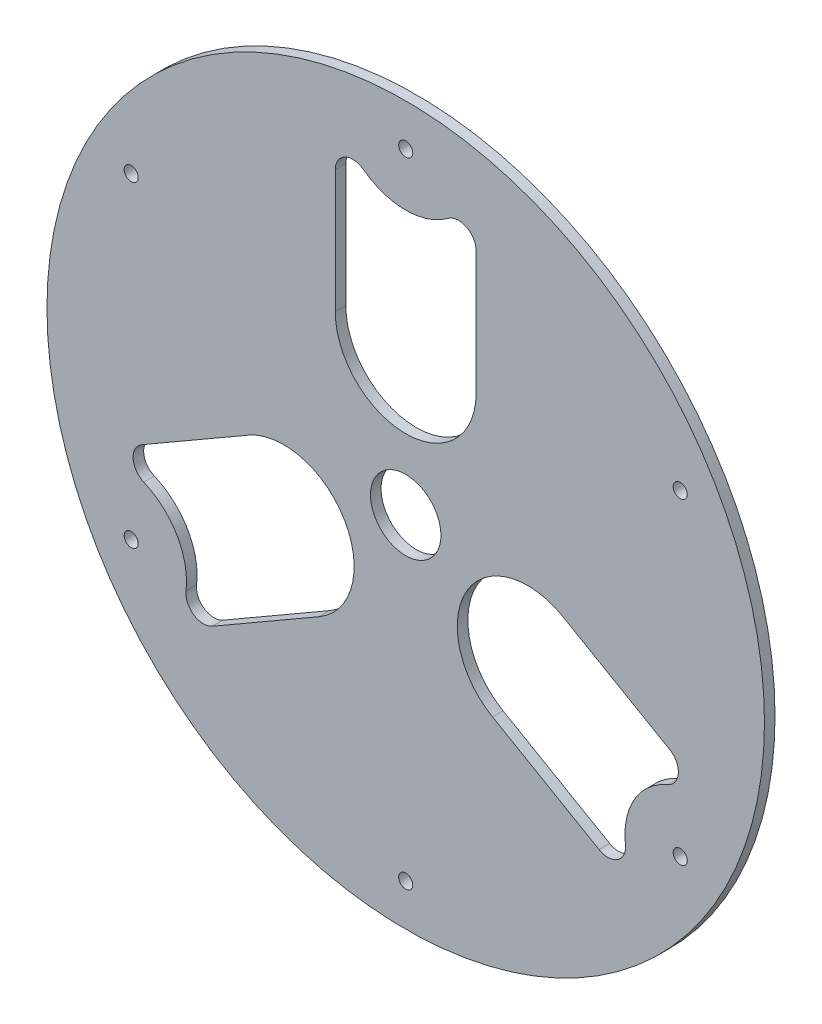
ISO-10303-21;
HEADER;
FILE_DESCRIPTION(('STEP AP214'),'2;1');
FILE_NAME('part.step','',(''),(''),'','','');
FILE_SCHEMA(('AUTOMOTIVE_DESIGN { 1 0 10303 214 1 1 1 1 }'));
ENDSEC;
DATA;
#1=APPLICATION_CONTEXT('core data for automotive mechanical design processes');
#2=APPLICATION_PROTOCOL_DEFINITION('international standard','automotive_design',2000,#1);
#3=PRODUCT_CONTEXT('',#1,'mechanical');
#4=PRODUCT('Part','Part','',(#3));
#5=PRODUCT_RELATED_PRODUCT_CATEGORY('part','',(#4));
#6=PRODUCT_DEFINITION_FORMATION('','',#4);
#7=PRODUCT_DEFINITION_CONTEXT('part definition',#1,'design');
#8=PRODUCT_DEFINITION('design','',#6,#7);
#9=PRODUCT_DEFINITION_SHAPE('','',#8);
#10=(LENGTH_UNIT() NAMED_UNIT(*) SI_UNIT(.MILLI.,.METRE.));
#11=(NAMED_UNIT(*) PLANE_ANGLE_UNIT() SI_UNIT($,.RADIAN.));
#12=(NAMED_UNIT(*) SI_UNIT($,.STERADIAN.) SOLID_ANGLE_UNIT());
#13=UNCERTAINTY_MEASURE_WITH_UNIT(LENGTH_MEASURE(1.E-05),#10,'distance_accuracy_value','');
#14=(GEOMETRIC_REPRESENTATION_CONTEXT(3) GLOBAL_UNCERTAINTY_ASSIGNED_CONTEXT((#13)) GLOBAL_UNIT_ASSIGNED_CONTEXT((#10,
#11,#12)) REPRESENTATION_CONTEXT('',''));
#15=CARTESIAN_POINT('',(0.,0.,0.));
#16=DIRECTION('',(0.,0.,1.));
#17=DIRECTION('',(1.,0.,0.));
#18=AXIS2_PLACEMENT_3D('',#15,#16,#17);
#19=CARTESIAN_POINT('',(0.,0.,3.));
#20=DIRECTION('',(0.,0.,1.));
#21=DIRECTION('',(1.,0.,0.));
#22=AXIS2_PLACEMENT_3D('',#19,#20,#21);
#23=PLANE('',#22);
#24=CARTESIAN_POINT('',(-77.9422863405937,-45.0000000000033,3.));
#25=DIRECTION('',(0.,0.,1.));
#26=DIRECTION('',(1.,0.,0.));
#27=AXIS2_PLACEMENT_3D('',#24,#25,#26);
#28=CIRCLE('',#27,2.0000000000073);
#29=CARTESIAN_POINT('',(-75.9422863405864,-45.0000000000033,3.));
#30=VERTEX_POINT('',#29);
#31=EDGE_CURVE('E340',#30,#30,#28,.T.);
#32=ORIENTED_EDGE('',*,*,#31,.F.);
#33=EDGE_LOOP('',(#32));
#34=FACE_BOUND('',#33,.T.);
#35=CARTESIAN_POINT('',(77.9422863406052,-44.9999999999967,3.));
#36=DIRECTION('',(0.,0.,1.));
#37=DIRECTION('',(1.,0.,0.));
#38=AXIS2_PLACEMENT_3D('',#35,#36,#37);
#39=CIRCLE('',#38,2.00000000000493);
#40=CARTESIAN_POINT('',(79.9422863406102,-44.9999999999967,3.));
#41=VERTEX_POINT('',#40);
#42=EDGE_CURVE('E343',#41,#41,#39,.T.);
#43=ORIENTED_EDGE('',*,*,#42,.F.);
#44=EDGE_LOOP('',(#43));
#45=FACE_BOUND('',#44,.T.);
#46=DIRECTION('',(0.866025403784438,0.5,0.));
#47=VECTOR('',#46,1.);
#48=CARTESIAN_POINT('',(-54.9130085495895,-54.7980510357057,3.));
#49=LINE('',#48,#47);
#50=CARTESIAN_POINT('',(-54.9130085495895,-54.7980510357057,3.));
#51=VERTEX_POINT('',#50);
#52=CARTESIAN_POINT('',(-24.641016151375,-37.3205080756902,3.));
#53=VERTEX_POINT('',#52);
#54=EDGE_CURVE('E166',#51,#53,#49,.T.);
#55=ORIENTED_EDGE('',*,*,#54,.F.);
#56=CARTESIAN_POINT('',(-57.4130085495894,-50.4679240167835,3.));
#57=DIRECTION('',(0.,0.,1.));
#58=DIRECTION('',(1.,0.,0.));
#59=AXIS2_PLACEMENT_3D('',#56,#57,#58);
#60=CIRCLE('',#59,4.99999999999999);
#61=CARTESIAN_POINT('',(-62.3771101647272,-49.8698478054302,3.));
#62=VERTEX_POINT('',#61);
#63=EDGE_CURVE('E158',#62,#51,#60,.T.);
#64=ORIENTED_EDGE('',*,*,#63,.F.);
#65=CARTESIAN_POINT('',(-82.2335166252782,-47.477542960017,3.));
#66=DIRECTION('',(0.,0.,-1.));
#67=DIRECTION('',(1.,0.,0.));
#68=AXIS2_PLACEMENT_3D('',#65,#66,#67);
#69=CIRCLE('',#68,20.);
#70=CARTESIAN_POINT('',(-74.3771101647272,-29.0852381146037,3.));
#71=VERTEX_POINT('',#70);
#72=EDGE_CURVE('E189',#71,#62,#69,.T.);
#73=ORIENTED_EDGE('',*,*,#72,.F.);
#74=CARTESIAN_POINT('',(-72.4130085495895,-24.4871619032504,3.));
#75=DIRECTION('',(0.,0.,1.));
#76=DIRECTION('',(1.,0.,0.));
#77=AXIS2_PLACEMENT_3D('',#74,#75,#76);
#78=CIRCLE('',#77,5.);
#79=CARTESIAN_POINT('',(-74.9130085495895,-20.1570348843282,3.));
#80=VERTEX_POINT('',#79);
#81=EDGE_CURVE('E187',#80,#71,#78,.T.);
#82=ORIENTED_EDGE('',*,*,#81,.F.);
#83=DIRECTION('',(-0.866025403784438,-0.500000000000001,0.));
#84=VECTOR('',#83,1.);
#85=CARTESIAN_POINT('',(-74.9130085495895,-20.1570348843282,3.));
#86=LINE('',#85,#84);
#87=CARTESIAN_POINT('',(-44.641016151375,-2.67949192431272,3.));
#88=VERTEX_POINT('',#87);
#89=EDGE_CURVE('E182',#88,#80,#86,.T.);
#90=ORIENTED_EDGE('',*,*,#89,.F.);
#91=CARTESIAN_POINT('',(-34.641016151375,-20.0000000000015,3.));
#92=DIRECTION('',(0.,0.,1.));
#93=DIRECTION('',(1.,0.,0.));
#94=AXIS2_PLACEMENT_3D('',#91,#92,#93);
#95=CIRCLE('',#94,20.);
#96=EDGE_CURVE('E180',#53,#88,#95,.T.);
#97=ORIENTED_EDGE('',*,*,#96,.F.);
#98=EDGE_LOOP('',(#55,#64,#73,#82,#90,#97));
#99=FACE_BOUND('',#98,.T.);
#100=DIRECTION('',(-0.866025403784439,0.5,0.));
#101=VECTOR('',#100,1.);
#102=CARTESIAN_POINT('',(74.9130085495946,-20.1570348843252,3.));
#103=LINE('',#102,#101);
#104=CARTESIAN_POINT('',(74.9130085495946,-20.1570348843252,3.));
#105=VERTEX_POINT('',#104);
#106=CARTESIAN_POINT('',(44.6410161513801,-2.67949192430974,3.));
#107=VERTEX_POINT('',#106);
#108=EDGE_CURVE('E214',#105,#107,#103,.T.);
#109=ORIENTED_EDGE('',*,*,#108,.F.);
#110=CARTESIAN_POINT('',(72.4130085495946,-24.4871619032474,3.));
#111=DIRECTION('',(0.,0.,1.));
#112=DIRECTION('',(1.,0.,0.));
#113=AXIS2_PLACEMENT_3D('',#110,#111,#112);
#114=CIRCLE('',#113,5.);
#115=CARTESIAN_POINT('',(74.3771101647323,-29.0852381146007,3.));
#116=VERTEX_POINT('',#115);
#117=EDGE_CURVE('E212',#116,#105,#114,.T.);
#118=ORIENTED_EDGE('',*,*,#117,.F.);
#119=CARTESIAN_POINT('',(82.2335166252834,-47.477542960014,3.));
#120=DIRECTION('',(0.,0.,-1.));
#121=DIRECTION('',(1.,0.,0.));
#122=AXIS2_PLACEMENT_3D('',#119,#120,#121);
#123=CIRCLE('',#122,20.);
#124=CARTESIAN_POINT('',(62.3771101647323,-49.8698478054272,3.));
#125=VERTEX_POINT('',#124);
#126=EDGE_CURVE('E224',#125,#116,#123,.T.);
#127=ORIENTED_EDGE('',*,*,#126,.F.);
#128=CARTESIAN_POINT('',(57.4130085495946,-50.4679240167805,3.));
#129=DIRECTION('',(0.,0.,1.));
#130=DIRECTION('',(1.,0.,0.));
#131=AXIS2_PLACEMENT_3D('',#128,#129,#130);
#132=CIRCLE('',#131,5.);
#133=CARTESIAN_POINT('',(54.9130085495946,-54.7980510357027,3.));
#134=VERTEX_POINT('',#133);
#135=EDGE_CURVE('E221',#134,#125,#132,.T.);
#136=ORIENTED_EDGE('',*,*,#135,.F.);
#137=DIRECTION('',(0.866025403784439,-0.5,0.));
#138=VECTOR('',#137,1.);
#139=CARTESIAN_POINT('',(54.9130085495946,-54.7980510357027,3.));
#140=LINE('',#139,#138);
#141=CARTESIAN_POINT('',(24.6410161513801,-37.3205080756873,3.));
#142=VERTEX_POINT('',#141);
#143=EDGE_CURVE('E219',#142,#134,#140,.T.);
#144=ORIENTED_EDGE('',*,*,#143,.F.);
#145=CARTESIAN_POINT('',(34.6410161513801,-19.9999999999985,3.));
#146=DIRECTION('',(0.,0.,1.));
#147=DIRECTION('',(1.,0.,0.));
#148=AXIS2_PLACEMENT_3D('',#145,#146,#147);
#149=CIRCLE('',#148,20.);
#150=EDGE_CURVE('E217',#107,#142,#149,.T.);
#151=ORIENTED_EDGE('',*,*,#150,.F.);
#152=EDGE_LOOP('',(#109,#118,#127,#136,#144,#151));
#153=FACE_BOUND('',#152,.T.);
#154=CARTESIAN_POINT('',(0.,0.,3.));
#155=DIRECTION('',(0.,0.,1.));
#156=DIRECTION('',(1.,0.,0.));
#157=AXIS2_PLACEMENT_3D('',#154,#155,#156);
#158=CIRCLE('',#157,10.);
#159=CARTESIAN_POINT('',(10.,0.,3.));
#160=VERTEX_POINT('',#159);
#161=EDGE_CURVE('E257',#160,#160,#158,.T.);
#162=ORIENTED_EDGE('',*,*,#161,.F.);
#163=EDGE_LOOP('',(#162));
#164=FACE_BOUND('',#163,.T.);
#165=CARTESIAN_POINT('',(0.,0.,3.));
#166=DIRECTION('',(0.,0.,1.));
#167=DIRECTION('',(1.,0.,0.));
#168=AXIS2_PLACEMENT_3D('',#165,#166,#167);
#169=CIRCLE('',#168,101.859163578813);
#170=CARTESIAN_POINT('',(101.859163578813,0.,3.));
#171=VERTEX_POINT('',#170);
#172=EDGE_CURVE('E11',#171,#171,#169,.T.);
#173=ORIENTED_EDGE('',*,*,#172,.T.);
#174=EDGE_LOOP('',(#173));
#175=FACE_BOUND('',#174,.T.);
#176=CARTESIAN_POINT('',(0.,90.,3.));
#177=DIRECTION('',(0.,0.,1.));
#178=DIRECTION('',(1.,0.,0.));
#179=AXIS2_PLACEMENT_3D('',#176,#177,#178);
#180=CIRCLE('',#179,2.);
#181=CARTESIAN_POINT('',(2.,90.,3.));
#182=VERTEX_POINT('',#181);
#183=EDGE_CURVE('E308',#182,#182,#180,.T.);
#184=ORIENTED_EDGE('',*,*,#183,.F.);
#185=EDGE_LOOP('',(#184));
#186=FACE_BOUND('',#185,.T.);
#187=DIRECTION('',(0.,-1.,0.));
#188=VECTOR('',#187,1.);
#189=CARTESIAN_POINT('',(-20.,74.9550859200309,3.));
#190=LINE('',#189,#188);
#191=CARTESIAN_POINT('',(-20.,74.9550859200309,3.));
#192=VERTEX_POINT('',#191);
#193=CARTESIAN_POINT('',(-20.,40.,3.));
#194=VERTEX_POINT('',#193);
#195=EDGE_CURVE('E265',#192,#194,#190,.T.);
#196=ORIENTED_EDGE('',*,*,#195,.F.);
#197=CARTESIAN_POINT('',(-15.,74.9550859200309,3.));
#198=DIRECTION('',(0.,0.,1.));
#199=DIRECTION('',(1.,0.,0.));
#200=AXIS2_PLACEMENT_3D('',#197,#198,#199);
#201=CIRCLE('',#200,5.);
#202=CARTESIAN_POINT('',(-12.,78.9550859200309,3.));
#203=VERTEX_POINT('',#202);
#204=EDGE_CURVE('E263',#203,#192,#201,.T.);
#205=ORIENTED_EDGE('',*,*,#204,.F.);
#206=CARTESIAN_POINT('',(0.,94.9550859200309,3.));
#207=DIRECTION('',(0.,0.,-1.));
#208=DIRECTION('',(1.,0.,0.));
#209=AXIS2_PLACEMENT_3D('',#206,#207,#208);
#210=CIRCLE('',#209,20.);
#211=CARTESIAN_POINT('',(12.,78.9550859200309,3.));
#212=VERTEX_POINT('',#211);
#213=EDGE_CURVE('E275',#212,#203,#210,.T.);
#214=ORIENTED_EDGE('',*,*,#213,.F.);
#215=CARTESIAN_POINT('',(15.,74.9550859200309,3.));
#216=DIRECTION('',(0.,0.,1.));
#217=DIRECTION('',(1.,0.,0.));
#218=AXIS2_PLACEMENT_3D('',#215,#216,#217);
#219=CIRCLE('',#218,5.);
#220=CARTESIAN_POINT('',(20.,74.9550859200309,3.));
#221=VERTEX_POINT('',#220);
#222=EDGE_CURVE('E272',#221,#212,#219,.T.);
#223=ORIENTED_EDGE('',*,*,#222,.F.);
#224=DIRECTION('',(0.,1.,0.));
#225=VECTOR('',#224,1.);
#226=CARTESIAN_POINT('',(20.,74.9550859200309,3.));
#227=LINE('',#226,#225);
#228=CARTESIAN_POINT('',(20.,40.,3.));
#229=VERTEX_POINT('',#228);
#230=EDGE_CURVE('E270',#229,#221,#227,.T.);
#231=ORIENTED_EDGE('',*,*,#230,.F.);
#232=CARTESIAN_POINT('',(0.,40.,3.));
#233=DIRECTION('',(0.,0.,1.));
#234=DIRECTION('',(1.,0.,0.));
#235=AXIS2_PLACEMENT_3D('',#232,#233,#234);
#236=CIRCLE('',#235,20.);
#237=EDGE_CURVE('E268',#194,#229,#236,.T.);
#238=ORIENTED_EDGE('',*,*,#237,.F.);
#239=EDGE_LOOP('',(#196,#205,#214,#223,#231,#238));
#240=FACE_BOUND('',#239,.T.);
#241=CARTESIAN_POINT('',(77.9422863406014,45.0000000000033,3.));
#242=DIRECTION('',(0.,0.,1.));
#243=DIRECTION('',(1.,0.,0.));
#244=AXIS2_PLACEMENT_3D('',#241,#242,#243);
#245=CIRCLE('',#244,2.00000000000108);
#246=CARTESIAN_POINT('',(79.9422863406024,45.0000000000033,3.));
#247=VERTEX_POINT('',#246);
#248=EDGE_CURVE('E192',#247,#247,#245,.T.);
#249=ORIENTED_EDGE('',*,*,#248,.F.);
#250=EDGE_LOOP('',(#249));
#251=FACE_BOUND('',#250,.T.);
#252=CARTESIAN_POINT('',(7.65181790382443E-12,-90.,3.));
#253=DIRECTION('',(0.,0.,1.));
#254=DIRECTION('',(1.,0.,0.));
#255=AXIS2_PLACEMENT_3D('',#252,#253,#254);
#256=CIRCLE('',#255,2.00000000000792);
#257=CARTESIAN_POINT('',(2.00000000001557,-90.,3.));
#258=VERTEX_POINT('',#257);
#259=EDGE_CURVE('E350',#258,#258,#256,.T.);
#260=ORIENTED_EDGE('',*,*,#259,.F.);
#261=EDGE_LOOP('',(#260));
#262=FACE_BOUND('',#261,.T.);
#263=CARTESIAN_POINT('',(-77.9422863405976,44.9999999999966,3.));
#264=DIRECTION('',(0.,0.,1.));
#265=DIRECTION('',(1.,0.,0.));
#266=AXIS2_PLACEMENT_3D('',#263,#264,#265);
#267=CIRCLE('',#266,2.00000000000387);
#268=CARTESIAN_POINT('',(-75.9422863405937,44.9999999999966,3.));
#269=VERTEX_POINT('',#268);
#270=EDGE_CURVE('E368',#269,#269,#267,.T.);
#271=ORIENTED_EDGE('',*,*,#270,.F.);
#272=EDGE_LOOP('',(#271));
#273=FACE_BOUND('',#272,.T.);
#274=ADVANCED_FACE('F33',(#34,#45,#99,#153,#164,#175,#186,#240,#251,#262,#273),#23,.T.);
#275=CARTESIAN_POINT('',(0.,0.,0.));
#276=DIRECTION('',(0.,0.,1.));
#277=DIRECTION('',(1.,0.,0.));
#278=AXIS2_PLACEMENT_3D('',#275,#276,#277);
#279=PLANE('',#278);
#280=CARTESIAN_POINT('',(72.4130085495946,-24.4871619032474,0.));
#281=DIRECTION('',(0.,0.,1.));
#282=DIRECTION('',(1.,0.,0.));
#283=AXIS2_PLACEMENT_3D('',#280,#281,#282);
#284=CIRCLE('',#283,5.);
#285=CARTESIAN_POINT('',(74.3771101647323,-29.0852381146007,0.));
#286=VERTEX_POINT('',#285);
#287=CARTESIAN_POINT('',(74.9130085495946,-20.1570348843252,0.));
#288=VERTEX_POINT('',#287);
#289=EDGE_CURVE('E174',#286,#288,#284,.T.);
#290=ORIENTED_EDGE('',*,*,#289,.T.);
#291=DIRECTION('',(-0.866025403784439,0.5,0.));
#292=VECTOR('',#291,1.);
#293=CARTESIAN_POINT('',(74.9130085495946,-20.1570348843252,0.));
#294=LINE('',#293,#292);
#295=CARTESIAN_POINT('',(44.6410161513801,-2.67949192430974,0.));
#296=VERTEX_POINT('',#295);
#297=EDGE_CURVE('E229',#288,#296,#294,.T.);
#298=ORIENTED_EDGE('',*,*,#297,.T.);
#299=CARTESIAN_POINT('',(34.6410161513801,-19.9999999999985,0.));
#300=DIRECTION('',(0.,0.,1.));
#301=DIRECTION('',(1.,0.,0.));
#302=AXIS2_PLACEMENT_3D('',#299,#300,#301);
#303=CIRCLE('',#302,20.);
#304=CARTESIAN_POINT('',(24.6410161513801,-37.3205080756873,0.));
#305=VERTEX_POINT('',#304);
#306=EDGE_CURVE('E232',#296,#305,#303,.T.);
#307=ORIENTED_EDGE('',*,*,#306,.T.);
#308=DIRECTION('',(0.866025403784439,-0.5,0.));
#309=VECTOR('',#308,1.);
#310=CARTESIAN_POINT('',(54.9130085495946,-54.7980510357027,0.));
#311=LINE('',#310,#309);
#312=CARTESIAN_POINT('',(54.9130085495946,-54.7980510357027,0.));
#313=VERTEX_POINT('',#312);
#314=EDGE_CURVE('E235',#305,#313,#311,.T.);
#315=ORIENTED_EDGE('',*,*,#314,.T.);
#316=CARTESIAN_POINT('',(57.4130085495946,-50.4679240167805,0.));
#317=DIRECTION('',(0.,0.,1.));
#318=DIRECTION('',(1.,0.,0.));
#319=AXIS2_PLACEMENT_3D('',#316,#317,#318);
#320=CIRCLE('',#319,5.);
#321=CARTESIAN_POINT('',(62.3771101647323,-49.8698478054272,0.));
#322=VERTEX_POINT('',#321);
#323=EDGE_CURVE('E238',#313,#322,#320,.T.);
#324=ORIENTED_EDGE('',*,*,#323,.T.);
#325=CARTESIAN_POINT('',(82.2335166252834,-47.477542960014,0.));
#326=DIRECTION('',(0.,0.,-1.));
#327=DIRECTION('',(1.,0.,0.));
#328=AXIS2_PLACEMENT_3D('',#325,#326,#327);
#329=CIRCLE('',#328,20.);
#330=EDGE_CURVE('E215',#322,#286,#329,.T.);
#331=ORIENTED_EDGE('',*,*,#330,.T.);
#332=EDGE_LOOP('',(#290,#298,#307,#315,#324,#331));
#333=FACE_BOUND('',#332,.T.);
#334=CARTESIAN_POINT('',(0.,90.,0.));
#335=DIRECTION('',(0.,0.,1.));
#336=DIRECTION('',(1.,0.,0.));
#337=AXIS2_PLACEMENT_3D('',#334,#335,#336);
#338=CIRCLE('',#337,2.);
#339=CARTESIAN_POINT('',(2.,90.,0.));
#340=VERTEX_POINT('',#339);
#341=EDGE_CURVE('E307',#340,#340,#338,.T.);
#342=ORIENTED_EDGE('',*,*,#341,.T.);
#343=EDGE_LOOP('',(#342));
#344=FACE_BOUND('',#343,.T.);
#345=CARTESIAN_POINT('',(0.,0.,0.));
#346=DIRECTION('',(0.,0.,1.));
#347=DIRECTION('',(1.,0.,0.));
#348=AXIS2_PLACEMENT_3D('',#345,#346,#347);
#349=CIRCLE('',#348,101.859163578813);
#350=CARTESIAN_POINT('',(101.859163578813,0.,0.));
#351=VERTEX_POINT('',#350);
#352=EDGE_CURVE('E37',#351,#351,#349,.T.);
#353=ORIENTED_EDGE('',*,*,#352,.F.);
#354=EDGE_LOOP('',(#353));
#355=FACE_BOUND('',#354,.T.);
#356=CARTESIAN_POINT('',(-15.,74.9550859200309,0.));
#357=DIRECTION('',(0.,0.,1.));
#358=DIRECTION('',(1.,0.,0.));
#359=AXIS2_PLACEMENT_3D('',#356,#357,#358);
#360=CIRCLE('',#359,5.);
#361=CARTESIAN_POINT('',(-12.,78.9550859200309,0.));
#362=VERTEX_POINT('',#361);
#363=CARTESIAN_POINT('',(-20.,74.9550859200309,0.));
#364=VERTEX_POINT('',#363);
#365=EDGE_CURVE('E260',#362,#364,#360,.T.);
#366=ORIENTED_EDGE('',*,*,#365,.T.);
#367=DIRECTION('',(0.,-1.,0.));
#368=VECTOR('',#367,1.);
#369=CARTESIAN_POINT('',(-20.,74.9550859200309,0.));
#370=LINE('',#369,#368);
#371=CARTESIAN_POINT('',(-20.,40.,0.));
#372=VERTEX_POINT('',#371);
#373=EDGE_CURVE('E280',#364,#372,#370,.T.);
#374=ORIENTED_EDGE('',*,*,#373,.T.);
#375=CARTESIAN_POINT('',(0.,40.,0.));
#376=DIRECTION('',(0.,0.,1.));
#377=DIRECTION('',(1.,0.,0.));
#378=AXIS2_PLACEMENT_3D('',#375,#376,#377);
#379=CIRCLE('',#378,20.);
#380=CARTESIAN_POINT('',(20.,40.,0.));
#381=VERTEX_POINT('',#380);
#382=EDGE_CURVE('E283',#372,#381,#379,.T.);
#383=ORIENTED_EDGE('',*,*,#382,.T.);
#384=DIRECTION('',(0.,1.,0.));
#385=VECTOR('',#384,1.);
#386=CARTESIAN_POINT('',(20.,74.9550859200309,0.));
#387=LINE('',#386,#385);
#388=CARTESIAN_POINT('',(20.,74.9550859200309,0.));
#389=VERTEX_POINT('',#388);
#390=EDGE_CURVE('E286',#381,#389,#387,.T.);
#391=ORIENTED_EDGE('',*,*,#390,.T.);
#392=CARTESIAN_POINT('',(15.,74.9550859200309,0.));
#393=DIRECTION('',(0.,0.,1.));
#394=DIRECTION('',(1.,0.,0.));
#395=AXIS2_PLACEMENT_3D('',#392,#393,#394);
#396=CIRCLE('',#395,5.);
#397=CARTESIAN_POINT('',(12.,78.9550859200309,0.));
#398=VERTEX_POINT('',#397);
#399=EDGE_CURVE('E289',#389,#398,#396,.T.);
#400=ORIENTED_EDGE('',*,*,#399,.T.);
#401=CARTESIAN_POINT('',(0.,94.9550859200309,0.));
#402=DIRECTION('',(0.,0.,-1.));
#403=DIRECTION('',(1.,0.,0.));
#404=AXIS2_PLACEMENT_3D('',#401,#402,#403);
#405=CIRCLE('',#404,20.);
#406=EDGE_CURVE('E266',#398,#362,#405,.T.);
#407=ORIENTED_EDGE('',*,*,#406,.T.);
#408=EDGE_LOOP('',(#366,#374,#383,#391,#400,#407));
#409=FACE_BOUND('',#408,.T.);
#410=CARTESIAN_POINT('',(0.,0.,0.));
#411=DIRECTION('',(0.,0.,1.));
#412=DIRECTION('',(1.,0.,0.));
#413=AXIS2_PLACEMENT_3D('',#410,#411,#412);
#414=CIRCLE('',#413,10.);
#415=CARTESIAN_POINT('',(10.,0.,0.));
#416=VERTEX_POINT('',#415);
#417=EDGE_CURVE('E256',#416,#416,#414,.T.);
#418=ORIENTED_EDGE('',*,*,#417,.T.);
#419=EDGE_LOOP('',(#418));
#420=FACE_BOUND('',#419,.T.);
#421=CARTESIAN_POINT('',(-57.4130085495894,-50.4679240167835,0.));
#422=DIRECTION('',(0.,0.,1.));
#423=DIRECTION('',(1.,0.,0.));
#424=AXIS2_PLACEMENT_3D('',#421,#422,#423);
#425=CIRCLE('',#424,4.99999999999999);
#426=CARTESIAN_POINT('',(-62.3771101647272,-49.8698478054302,0.));
#427=VERTEX_POINT('',#426);
#428=CARTESIAN_POINT('',(-54.9130085495895,-54.7980510357057,0.));
#429=VERTEX_POINT('',#428);
#430=EDGE_CURVE('E56',#427,#429,#425,.T.);
#431=ORIENTED_EDGE('',*,*,#430,.T.);
#432=DIRECTION('',(0.866025403784438,0.5,0.));
#433=VECTOR('',#432,1.);
#434=CARTESIAN_POINT('',(-54.9130085495895,-54.7980510357057,0.));
#435=LINE('',#434,#433);
#436=CARTESIAN_POINT('',(-24.641016151375,-37.3205080756902,0.));
#437=VERTEX_POINT('',#436);
#438=EDGE_CURVE('E173',#429,#437,#435,.T.);
#439=ORIENTED_EDGE('',*,*,#438,.T.);
#440=CARTESIAN_POINT('',(-34.641016151375,-20.0000000000015,0.));
#441=DIRECTION('',(0.,0.,1.));
#442=DIRECTION('',(1.,0.,0.));
#443=AXIS2_PLACEMENT_3D('',#440,#441,#442);
#444=CIRCLE('',#443,20.);
#445=CARTESIAN_POINT('',(-44.641016151375,-2.67949192431272,0.));
#446=VERTEX_POINT('',#445);
#447=EDGE_CURVE('E194',#437,#446,#444,.T.);
#448=ORIENTED_EDGE('',*,*,#447,.T.);
#449=DIRECTION('',(-0.866025403784438,-0.500000000000001,0.));
#450=VECTOR('',#449,1.);
#451=CARTESIAN_POINT('',(-74.9130085495895,-20.1570348843282,0.));
#452=LINE('',#451,#450);
#453=CARTESIAN_POINT('',(-74.9130085495895,-20.1570348843282,0.));
#454=VERTEX_POINT('',#453);
#455=EDGE_CURVE('E197',#446,#454,#452,.T.);
#456=ORIENTED_EDGE('',*,*,#455,.T.);
#457=CARTESIAN_POINT('',(-72.4130085495895,-24.4871619032504,0.));
#458=DIRECTION('',(0.,0.,1.));
#459=DIRECTION('',(1.,0.,0.));
#460=AXIS2_PLACEMENT_3D('',#457,#458,#459);
#461=CIRCLE('',#460,5.);
#462=CARTESIAN_POINT('',(-74.3771101647272,-29.0852381146037,0.));
#463=VERTEX_POINT('',#462);
#464=EDGE_CURVE('E200',#454,#463,#461,.T.);
#465=ORIENTED_EDGE('',*,*,#464,.T.);
#466=CARTESIAN_POINT('',(-82.2335166252782,-47.477542960017,0.));
#467=DIRECTION('',(0.,0.,-1.));
#468=DIRECTION('',(1.,0.,0.));
#469=AXIS2_PLACEMENT_3D('',#466,#467,#468);
#470=CIRCLE('',#469,20.);
#471=EDGE_CURVE('E167',#463,#427,#470,.T.);
#472=ORIENTED_EDGE('',*,*,#471,.T.);
#473=EDGE_LOOP('',(#431,#439,#448,#456,#465,#472));
#474=FACE_BOUND('',#473,.T.);
#475=CARTESIAN_POINT('',(77.9422863406014,45.0000000000033,0.));
#476=DIRECTION('',(0.,0.,1.));
#477=DIRECTION('',(1.,0.,0.));
#478=AXIS2_PLACEMENT_3D('',#475,#476,#477);
#479=CIRCLE('',#478,2.00000000000108);
#480=CARTESIAN_POINT('',(79.9422863406024,45.0000000000033,0.));
#481=VERTEX_POINT('',#480);
#482=EDGE_CURVE('E345',#481,#481,#479,.T.);
#483=ORIENTED_EDGE('',*,*,#482,.T.);
#484=EDGE_LOOP('',(#483));
#485=FACE_BOUND('',#484,.T.);
#486=CARTESIAN_POINT('',(77.9422863406052,-44.9999999999967,0.));
#487=DIRECTION('',(0.,0.,1.));
#488=DIRECTION('',(1.,0.,0.));
#489=AXIS2_PLACEMENT_3D('',#486,#487,#488);
#490=CIRCLE('',#489,2.00000000000493);
#491=CARTESIAN_POINT('',(79.9422863406102,-44.9999999999967,0.));
#492=VERTEX_POINT('',#491);
#493=EDGE_CURVE('E346',#492,#492,#490,.T.);
#494=ORIENTED_EDGE('',*,*,#493,.T.);
#495=EDGE_LOOP('',(#494));
#496=FACE_BOUND('',#495,.T.);
#497=CARTESIAN_POINT('',(7.65181790382443E-12,-90.,0.));
#498=DIRECTION('',(0.,0.,1.));
#499=DIRECTION('',(1.,0.,0.));
#500=AXIS2_PLACEMENT_3D('',#497,#498,#499);
#501=CIRCLE('',#500,2.00000000000792);
#502=CARTESIAN_POINT('',(2.00000000001557,-90.,0.));
#503=VERTEX_POINT('',#502);
#504=EDGE_CURVE('E353',#503,#503,#501,.T.);
#505=ORIENTED_EDGE('',*,*,#504,.T.);
#506=EDGE_LOOP('',(#505));
#507=FACE_BOUND('',#506,.T.);
#508=CARTESIAN_POINT('',(-77.9422863405937,-45.0000000000033,0.));
#509=DIRECTION('',(0.,0.,1.));
#510=DIRECTION('',(1.,0.,0.));
#511=AXIS2_PLACEMENT_3D('',#508,#509,#510);
#512=CIRCLE('',#511,2.0000000000073);
#513=CARTESIAN_POINT('',(-75.9422863405864,-45.0000000000033,0.));
#514=VERTEX_POINT('',#513);
#515=EDGE_CURVE('E370',#514,#514,#512,.T.);
#516=ORIENTED_EDGE('',*,*,#515,.T.);
#517=EDGE_LOOP('',(#516));
#518=FACE_BOUND('',#517,.T.);
#519=CARTESIAN_POINT('',(-77.9422863405976,44.9999999999966,0.));
#520=DIRECTION('',(0.,0.,1.));
#521=DIRECTION('',(1.,0.,0.));
#522=AXIS2_PLACEMENT_3D('',#519,#520,#521);
#523=CIRCLE('',#522,2.00000000000387);
#524=CARTESIAN_POINT('',(-75.9422863405937,44.9999999999966,0.));
#525=VERTEX_POINT('',#524);
#526=EDGE_CURVE('E371',#525,#525,#523,.T.);
#527=ORIENTED_EDGE('',*,*,#526,.T.);
#528=EDGE_LOOP('',(#527));
#529=FACE_BOUND('',#528,.T.);
#530=ADVANCED_FACE('F314',(#333,#344,#355,#409,#420,#474,#485,#496,#507,#518,#529),#279,.F.);
#531=CARTESIAN_POINT('',(0.,0.,3.));
#532=DIRECTION('',(0.,0.,-1.));
#533=DIRECTION('',(-1.,0.,0.));
#534=AXIS2_PLACEMENT_3D('',#531,#532,#533);
#535=CYLINDRICAL_SURFACE('',#534,101.859163578813);
#536=ORIENTED_EDGE('',*,*,#172,.F.);
#537=EDGE_LOOP('',(#536));
#538=FACE_BOUND('',#537,.T.);
#539=ORIENTED_EDGE('',*,*,#352,.T.);
#540=EDGE_LOOP('',(#539));
#541=FACE_BOUND('',#540,.T.);
#542=ADVANCED_FACE('F35',(#538,#541),#535,.T.);
#543=CARTESIAN_POINT('',(0.,90.,3.));
#544=DIRECTION('',(0.,0.,-1.));
#545=DIRECTION('',(-1.,0.,0.));
#546=AXIS2_PLACEMENT_3D('',#543,#544,#545);
#547=CYLINDRICAL_SURFACE('',#546,2.);
#548=ORIENTED_EDGE('',*,*,#183,.T.);
#549=EDGE_LOOP('',(#548));
#550=FACE_BOUND('',#549,.T.);
#551=ORIENTED_EDGE('',*,*,#341,.F.);
#552=EDGE_LOOP('',(#551));
#553=FACE_BOUND('',#552,.T.);
#554=ADVANCED_FACE('F317',(#550,#553),#547,.F.);
#555=CARTESIAN_POINT('',(-15.,74.9550859200309,3.));
#556=DIRECTION('',(0.,0.,-1.));
#557=DIRECTION('',(-1.,0.,0.));
#558=AXIS2_PLACEMENT_3D('',#555,#556,#557);
#559=CYLINDRICAL_SURFACE('',#558,5.);
#560=ORIENTED_EDGE('',*,*,#365,.F.);
#561=DIRECTION('',(0.,0.,-1.));
#562=VECTOR('',#561,1.);
#563=CARTESIAN_POINT('',(-12.,78.9550859200309,3.));
#564=LINE('',#563,#562);
#565=EDGE_CURVE('E277',#203,#362,#564,.T.);
#566=ORIENTED_EDGE('',*,*,#565,.F.);
#567=ORIENTED_EDGE('',*,*,#204,.T.);
#568=DIRECTION('',(0.,0.,-1.));
#569=VECTOR('',#568,1.);
#570=CARTESIAN_POINT('',(-20.,74.9550859200309,3.));
#571=LINE('',#570,#569);
#572=EDGE_CURVE('E304',#192,#364,#571,.T.);
#573=ORIENTED_EDGE('',*,*,#572,.T.);
#574=EDGE_LOOP('',(#560,#566,#567,#573));
#575=FACE_BOUND('',#574,.T.);
#576=ADVANCED_FACE('F319',(#575),#559,.F.);
#577=CARTESIAN_POINT('',(-20.,74.9550859200309,3.));
#578=DIRECTION('',(1.,0.,0.));
#579=DIRECTION('',(0.,1.,0.));
#580=AXIS2_PLACEMENT_3D('',#577,#578,#579);
#581=PLANE('',#580);
#582=ORIENTED_EDGE('',*,*,#373,.F.);
#583=ORIENTED_EDGE('',*,*,#572,.F.);
#584=ORIENTED_EDGE('',*,*,#195,.T.);
#585=DIRECTION('',(0.,0.,-1.));
#586=VECTOR('',#585,1.);
#587=CARTESIAN_POINT('',(-20.,40.,3.));
#588=LINE('',#587,#586);
#589=EDGE_CURVE('E302',#194,#372,#588,.T.);
#590=ORIENTED_EDGE('',*,*,#589,.T.);
#591=EDGE_LOOP('',(#582,#583,#584,#590));
#592=FACE_BOUND('',#591,.T.);
#593=ADVANCED_FACE('F326',(#592),#581,.T.);
#594=CARTESIAN_POINT('',(0.,40.,3.));
#595=DIRECTION('',(0.,0.,-1.));
#596=DIRECTION('',(-1.,0.,0.));
#597=AXIS2_PLACEMENT_3D('',#594,#595,#596);
#598=CYLINDRICAL_SURFACE('',#597,20.);
#599=ORIENTED_EDGE('',*,*,#382,.F.);
#600=ORIENTED_EDGE('',*,*,#589,.F.);
#601=ORIENTED_EDGE('',*,*,#237,.T.);
#602=DIRECTION('',(0.,0.,-1.));
#603=VECTOR('',#602,1.);
#604=CARTESIAN_POINT('',(20.,40.,3.));
#605=LINE('',#604,#603);
#606=EDGE_CURVE('E300',#229,#381,#605,.T.);
#607=ORIENTED_EDGE('',*,*,#606,.T.);
#608=EDGE_LOOP('',(#599,#600,#601,#607));
#609=FACE_BOUND('',#608,.T.);
#610=ADVANCED_FACE('F459',(#609),#598,.F.);
#611=CARTESIAN_POINT('',(20.,74.9550859200309,3.));
#612=DIRECTION('',(-1.,0.,0.));
#613=DIRECTION('',(0.,-1.,0.));
#614=AXIS2_PLACEMENT_3D('',#611,#612,#613);
#615=PLANE('',#614);
#616=ORIENTED_EDGE('',*,*,#390,.F.);
#617=ORIENTED_EDGE('',*,*,#606,.F.);
#618=ORIENTED_EDGE('',*,*,#230,.T.);
#619=DIRECTION('',(0.,0.,-1.));
#620=VECTOR('',#619,1.);
#621=CARTESIAN_POINT('',(20.,74.9550859200309,3.));
#622=LINE('',#621,#620);
#623=EDGE_CURVE('E298',#221,#389,#622,.T.);
#624=ORIENTED_EDGE('',*,*,#623,.T.);
#625=EDGE_LOOP('',(#616,#617,#618,#624));
#626=FACE_BOUND('',#625,.T.);
#627=ADVANCED_FACE('F455',(#626),#615,.T.);
#628=CARTESIAN_POINT('',(15.,74.9550859200309,3.));
#629=DIRECTION('',(0.,0.,-1.));
#630=DIRECTION('',(-1.,0.,0.));
#631=AXIS2_PLACEMENT_3D('',#628,#629,#630);
#632=CYLINDRICAL_SURFACE('',#631,5.);
#633=ORIENTED_EDGE('',*,*,#399,.F.);
#634=ORIENTED_EDGE('',*,*,#623,.F.);
#635=ORIENTED_EDGE('',*,*,#222,.T.);
#636=DIRECTION('',(0.,0.,-1.));
#637=VECTOR('',#636,1.);
#638=CARTESIAN_POINT('',(12.,78.9550859200309,3.));
#639=LINE('',#638,#637);
#640=EDGE_CURVE('E296',#212,#398,#639,.T.);
#641=ORIENTED_EDGE('',*,*,#640,.T.);
#642=EDGE_LOOP('',(#633,#634,#635,#641));
#643=FACE_BOUND('',#642,.T.);
#644=ADVANCED_FACE('F451',(#643),#632,.F.);
#645=CARTESIAN_POINT('',(0.,94.9550859200309,3.));
#646=DIRECTION('',(0.,0.,-1.));
#647=DIRECTION('',(-1.,0.,0.));
#648=AXIS2_PLACEMENT_3D('',#645,#646,#647);
#649=CYLINDRICAL_SURFACE('',#648,20.);
#650=ORIENTED_EDGE('',*,*,#406,.F.);
#651=ORIENTED_EDGE('',*,*,#640,.F.);
#652=ORIENTED_EDGE('',*,*,#213,.T.);
#653=ORIENTED_EDGE('',*,*,#565,.T.);
#654=EDGE_LOOP('',(#650,#651,#652,#653));
#655=FACE_BOUND('',#654,.T.);
#656=ADVANCED_FACE('F447',(#655),#649,.T.);
#657=CARTESIAN_POINT('',(0.,0.,3.));
#658=DIRECTION('',(0.,0.,-1.));
#659=DIRECTION('',(-1.,0.,0.));
#660=AXIS2_PLACEMENT_3D('',#657,#658,#659);
#661=CYLINDRICAL_SURFACE('',#660,10.);
#662=ORIENTED_EDGE('',*,*,#161,.T.);
#663=EDGE_LOOP('',(#662));
#664=FACE_BOUND('',#663,.T.);
#665=ORIENTED_EDGE('',*,*,#417,.F.);
#666=EDGE_LOOP('',(#665));
#667=FACE_BOUND('',#666,.T.);
#668=ADVANCED_FACE('F443',(#664,#667),#661,.F.);
#669=CARTESIAN_POINT('',(72.4130085495946,-24.4871619032474,3.));
#670=DIRECTION('',(0.,0.,-1.));
#671=DIRECTION('',(-1.,0.,0.));
#672=AXIS2_PLACEMENT_3D('',#669,#670,#671);
#673=CYLINDRICAL_SURFACE('',#672,5.);
#674=ORIENTED_EDGE('',*,*,#289,.F.);
#675=DIRECTION('',(0.,0.,-1.));
#676=VECTOR('',#675,1.);
#677=CARTESIAN_POINT('',(74.3771101647323,-29.0852381146007,3.));
#678=LINE('',#677,#676);
#679=EDGE_CURVE('E226',#116,#286,#678,.T.);
#680=ORIENTED_EDGE('',*,*,#679,.F.);
#681=ORIENTED_EDGE('',*,*,#117,.T.);
#682=DIRECTION('',(0.,0.,-1.));
#683=VECTOR('',#682,1.);
#684=CARTESIAN_POINT('',(74.9130085495946,-20.1570348843252,3.));
#685=LINE('',#684,#683);
#686=EDGE_CURVE('E253',#105,#288,#685,.T.);
#687=ORIENTED_EDGE('',*,*,#686,.T.);
#688=EDGE_LOOP('',(#674,#680,#681,#687));
#689=FACE_BOUND('',#688,.T.);
#690=ADVANCED_FACE('F439',(#689),#673,.F.);
#691=CARTESIAN_POINT('',(74.9130085495946,-20.1570348843252,3.));
#692=DIRECTION('',(-0.5,-0.866025403784439,0.));
#693=DIRECTION('',(0.866025403784439,-0.5,0.));
#694=AXIS2_PLACEMENT_3D('',#691,#692,#693);
#695=PLANE('',#694);
#696=ORIENTED_EDGE('',*,*,#297,.F.);
#697=ORIENTED_EDGE('',*,*,#686,.F.);
#698=ORIENTED_EDGE('',*,*,#108,.T.);
#699=DIRECTION('',(0.,0.,-1.));
#700=VECTOR('',#699,1.);
#701=CARTESIAN_POINT('',(44.6410161513801,-2.67949192430974,3.));
#702=LINE('',#701,#700);
#703=EDGE_CURVE('E251',#107,#296,#702,.T.);
#704=ORIENTED_EDGE('',*,*,#703,.T.);
#705=EDGE_LOOP('',(#696,#697,#698,#704));
#706=FACE_BOUND('',#705,.T.);
#707=ADVANCED_FACE('F435',(#706),#695,.T.);
#708=CARTESIAN_POINT('',(34.6410161513801,-19.9999999999985,3.));
#709=DIRECTION('',(0.,0.,-1.));
#710=DIRECTION('',(-1.,0.,0.));
#711=AXIS2_PLACEMENT_3D('',#708,#709,#710);
#712=CYLINDRICAL_SURFACE('',#711,20.);
#713=ORIENTED_EDGE('',*,*,#306,.F.);
#714=ORIENTED_EDGE('',*,*,#703,.F.);
#715=ORIENTED_EDGE('',*,*,#150,.T.);
#716=DIRECTION('',(0.,0.,-1.));
#717=VECTOR('',#716,1.);
#718=CARTESIAN_POINT('',(24.6410161513801,-37.3205080756873,3.));
#719=LINE('',#718,#717);
#720=EDGE_CURVE('E249',#142,#305,#719,.T.);
#721=ORIENTED_EDGE('',*,*,#720,.T.);
#722=EDGE_LOOP('',(#713,#714,#715,#721));
#723=FACE_BOUND('',#722,.T.);
#724=ADVANCED_FACE('F431',(#723),#712,.F.);
#725=CARTESIAN_POINT('',(54.9130085495946,-54.7980510357027,3.));
#726=DIRECTION('',(0.5,0.866025403784439,0.));
#727=DIRECTION('',(-0.866025403784439,0.5,0.));
#728=AXIS2_PLACEMENT_3D('',#725,#726,#727);
#729=PLANE('',#728);
#730=ORIENTED_EDGE('',*,*,#314,.F.);
#731=ORIENTED_EDGE('',*,*,#720,.F.);
#732=ORIENTED_EDGE('',*,*,#143,.T.);
#733=DIRECTION('',(0.,0.,-1.));
#734=VECTOR('',#733,1.);
#735=CARTESIAN_POINT('',(54.9130085495946,-54.7980510357027,3.));
#736=LINE('',#735,#734);
#737=EDGE_CURVE('E247',#134,#313,#736,.T.);
#738=ORIENTED_EDGE('',*,*,#737,.T.);
#739=EDGE_LOOP('',(#730,#731,#732,#738));
#740=FACE_BOUND('',#739,.T.);
#741=ADVANCED_FACE('F427',(#740),#729,.T.);
#742=CARTESIAN_POINT('',(57.4130085495946,-50.4679240167805,3.));
#743=DIRECTION('',(0.,0.,-1.));
#744=DIRECTION('',(-1.,0.,0.));
#745=AXIS2_PLACEMENT_3D('',#742,#743,#744);
#746=CYLINDRICAL_SURFACE('',#745,5.);
#747=ORIENTED_EDGE('',*,*,#323,.F.);
#748=ORIENTED_EDGE('',*,*,#737,.F.);
#749=ORIENTED_EDGE('',*,*,#135,.T.);
#750=DIRECTION('',(0.,0.,-1.));
#751=VECTOR('',#750,1.);
#752=CARTESIAN_POINT('',(62.3771101647323,-49.8698478054272,3.));
#753=LINE('',#752,#751);
#754=EDGE_CURVE('E245',#125,#322,#753,.T.);
#755=ORIENTED_EDGE('',*,*,#754,.T.);
#756=EDGE_LOOP('',(#747,#748,#749,#755));
#757=FACE_BOUND('',#756,.T.);
#758=ADVANCED_FACE('F423',(#757),#746,.F.);
#759=CARTESIAN_POINT('',(82.2335166252834,-47.477542960014,3.));
#760=DIRECTION('',(0.,0.,-1.));
#761=DIRECTION('',(-1.,0.,0.));
#762=AXIS2_PLACEMENT_3D('',#759,#760,#761);
#763=CYLINDRICAL_SURFACE('',#762,20.);
#764=ORIENTED_EDGE('',*,*,#330,.F.);
#765=ORIENTED_EDGE('',*,*,#754,.F.);
#766=ORIENTED_EDGE('',*,*,#126,.T.);
#767=ORIENTED_EDGE('',*,*,#679,.T.);
#768=EDGE_LOOP('',(#764,#765,#766,#767));
#769=FACE_BOUND('',#768,.T.);
#770=ADVANCED_FACE('F420',(#769),#763,.T.);
#771=CARTESIAN_POINT('',(-57.4130085495894,-50.4679240167835,3.));
#772=DIRECTION('',(0.,0.,-1.));
#773=DIRECTION('',(-1.,0.,0.));
#774=AXIS2_PLACEMENT_3D('',#771,#772,#773);
#775=CYLINDRICAL_SURFACE('',#774,4.99999999999999);
#776=ORIENTED_EDGE('',*,*,#430,.F.);
#777=DIRECTION('',(0.,0.,-1.));
#778=VECTOR('',#777,1.);
#779=CARTESIAN_POINT('',(-62.3771101647272,-49.8698478054302,3.));
#780=LINE('',#779,#778);
#781=EDGE_CURVE('E162',#62,#427,#780,.T.);
#782=ORIENTED_EDGE('',*,*,#781,.F.);
#783=ORIENTED_EDGE('',*,*,#63,.T.);
#784=DIRECTION('',(0.,0.,-1.));
#785=VECTOR('',#784,1.);
#786=CARTESIAN_POINT('',(-54.9130085495895,-54.7980510357057,3.));
#787=LINE('',#786,#785);
#788=EDGE_CURVE('E161',#51,#429,#787,.T.);
#789=ORIENTED_EDGE('',*,*,#788,.T.);
#790=EDGE_LOOP('',(#776,#782,#783,#789));
#791=FACE_BOUND('',#790,.T.);
#792=ADVANCED_FACE('F160',(#791),#775,.F.);
#793=CARTESIAN_POINT('',(-54.9130085495895,-54.7980510357057,3.));
#794=DIRECTION('',(-0.500000000000001,0.866025403784438,0.));
#795=DIRECTION('',(-0.866025403784438,-0.500000000000001,0.));
#796=AXIS2_PLACEMENT_3D('',#793,#794,#795);
#797=PLANE('',#796);
#798=ORIENTED_EDGE('',*,*,#438,.F.);
#799=ORIENTED_EDGE('',*,*,#788,.F.);
#800=ORIENTED_EDGE('',*,*,#54,.T.);
#801=DIRECTION('',(0.,0.,-1.));
#802=VECTOR('',#801,1.);
#803=CARTESIAN_POINT('',(-24.641016151375,-37.3205080756902,3.));
#804=LINE('',#803,#802);
#805=EDGE_CURVE('E175',#53,#437,#804,.T.);
#806=ORIENTED_EDGE('',*,*,#805,.T.);
#807=EDGE_LOOP('',(#798,#799,#800,#806));
#808=FACE_BOUND('',#807,.T.);
#809=ADVANCED_FACE('F170',(#808),#797,.T.);
#810=CARTESIAN_POINT('',(-34.641016151375,-20.0000000000015,3.));
#811=DIRECTION('',(0.,0.,-1.));
#812=DIRECTION('',(-1.,0.,0.));
#813=AXIS2_PLACEMENT_3D('',#810,#811,#812);
#814=CYLINDRICAL_SURFACE('',#813,20.);
#815=ORIENTED_EDGE('',*,*,#447,.F.);
#816=ORIENTED_EDGE('',*,*,#805,.F.);
#817=ORIENTED_EDGE('',*,*,#96,.T.);
#818=DIRECTION('',(0.,0.,-1.));
#819=VECTOR('',#818,1.);
#820=CARTESIAN_POINT('',(-44.641016151375,-2.67949192431272,3.));
#821=LINE('',#820,#819);
#822=EDGE_CURVE('E209',#88,#446,#821,.T.);
#823=ORIENTED_EDGE('',*,*,#822,.T.);
#824=EDGE_LOOP('',(#815,#816,#817,#823));
#825=FACE_BOUND('',#824,.T.);
#826=ADVANCED_FACE('F411',(#825),#814,.F.);
#827=CARTESIAN_POINT('',(-74.9130085495895,-20.1570348843282,3.));
#828=DIRECTION('',(0.500000000000001,-0.866025403784438,0.));
#829=DIRECTION('',(0.866025403784438,0.500000000000001,0.));
#830=AXIS2_PLACEMENT_3D('',#827,#828,#829);
#831=PLANE('',#830);
#832=ORIENTED_EDGE('',*,*,#455,.F.);
#833=ORIENTED_EDGE('',*,*,#822,.F.);
#834=ORIENTED_EDGE('',*,*,#89,.T.);
#835=DIRECTION('',(0.,0.,-1.));
#836=VECTOR('',#835,1.);
#837=CARTESIAN_POINT('',(-74.9130085495895,-20.1570348843282,3.));
#838=LINE('',#837,#836);
#839=EDGE_CURVE('E207',#80,#454,#838,.T.);
#840=ORIENTED_EDGE('',*,*,#839,.T.);
#841=EDGE_LOOP('',(#832,#833,#834,#840));
#842=FACE_BOUND('',#841,.T.);
#843=ADVANCED_FACE('F407',(#842),#831,.T.);
#844=CARTESIAN_POINT('',(-72.4130085495895,-24.4871619032504,3.));
#845=DIRECTION('',(0.,0.,-1.));
#846=DIRECTION('',(-1.,0.,0.));
#847=AXIS2_PLACEMENT_3D('',#844,#845,#846);
#848=CYLINDRICAL_SURFACE('',#847,5.);
#849=ORIENTED_EDGE('',*,*,#464,.F.);
#850=ORIENTED_EDGE('',*,*,#839,.F.);
#851=ORIENTED_EDGE('',*,*,#81,.T.);
#852=DIRECTION('',(0.,0.,-1.));
#853=VECTOR('',#852,1.);
#854=CARTESIAN_POINT('',(-74.3771101647272,-29.0852381146037,3.));
#855=LINE('',#854,#853);
#856=EDGE_CURVE('E48',#71,#463,#855,.T.);
#857=ORIENTED_EDGE('',*,*,#856,.T.);
#858=EDGE_LOOP('',(#849,#850,#851,#857));
#859=FACE_BOUND('',#858,.T.);
#860=ADVANCED_FACE('F404',(#859),#848,.F.);
#861=CARTESIAN_POINT('',(-82.2335166252782,-47.477542960017,3.));
#862=DIRECTION('',(0.,0.,-1.));
#863=DIRECTION('',(-1.,0.,0.));
#864=AXIS2_PLACEMENT_3D('',#861,#862,#863);
#865=CYLINDRICAL_SURFACE('',#864,20.);
#866=ORIENTED_EDGE('',*,*,#471,.F.);
#867=ORIENTED_EDGE('',*,*,#856,.F.);
#868=ORIENTED_EDGE('',*,*,#72,.T.);
#869=ORIENTED_EDGE('',*,*,#781,.T.);
#870=EDGE_LOOP('',(#866,#867,#868,#869));
#871=FACE_BOUND('',#870,.T.);
#872=ADVANCED_FACE('F401',(#871),#865,.T.);
#873=CARTESIAN_POINT('',(77.9422863406014,45.0000000000033,3.));
#874=DIRECTION('',(0.,0.,-1.));
#875=DIRECTION('',(-1.,0.,0.));
#876=AXIS2_PLACEMENT_3D('',#873,#874,#875);
#877=CYLINDRICAL_SURFACE('',#876,2.00000000000108);
#878=ORIENTED_EDGE('',*,*,#248,.T.);
#879=EDGE_LOOP('',(#878));
#880=FACE_BOUND('',#879,.T.);
#881=ORIENTED_EDGE('',*,*,#482,.F.);
#882=EDGE_LOOP('',(#881));
#883=FACE_BOUND('',#882,.T.);
#884=ADVANCED_FACE('F359',(#880,#883),#877,.F.);
#885=CARTESIAN_POINT('',(77.9422863406052,-44.9999999999967,3.));
#886=DIRECTION('',(0.,0.,-1.));
#887=DIRECTION('',(-1.,0.,0.));
#888=AXIS2_PLACEMENT_3D('',#885,#886,#887);
#889=CYLINDRICAL_SURFACE('',#888,2.00000000000493);
#890=ORIENTED_EDGE('',*,*,#42,.T.);
#891=EDGE_LOOP('',(#890));
#892=FACE_BOUND('',#891,.T.);
#893=ORIENTED_EDGE('',*,*,#493,.F.);
#894=EDGE_LOOP('',(#893));
#895=FACE_BOUND('',#894,.T.);
#896=ADVANCED_FACE('F387',(#892,#895),#889,.F.);
#897=CARTESIAN_POINT('',(7.65181790382443E-12,-90.,3.));
#898=DIRECTION('',(0.,0.,-1.));
#899=DIRECTION('',(-1.,0.,0.));
#900=AXIS2_PLACEMENT_3D('',#897,#898,#899);
#901=CYLINDRICAL_SURFACE('',#900,2.00000000000792);
#902=ORIENTED_EDGE('',*,*,#259,.T.);
#903=EDGE_LOOP('',(#902));
#904=FACE_BOUND('',#903,.T.);
#905=ORIENTED_EDGE('',*,*,#504,.F.);
#906=EDGE_LOOP('',(#905));
#907=FACE_BOUND('',#906,.T.);
#908=ADVANCED_FACE('F384',(#904,#907),#901,.F.);
#909=CARTESIAN_POINT('',(-77.9422863405937,-45.0000000000033,3.));
#910=DIRECTION('',(0.,0.,-1.));
#911=DIRECTION('',(-1.,0.,0.));
#912=AXIS2_PLACEMENT_3D('',#909,#910,#911);
#913=CYLINDRICAL_SURFACE('',#912,2.0000000000073);
#914=ORIENTED_EDGE('',*,*,#31,.T.);
#915=EDGE_LOOP('',(#914));
#916=FACE_BOUND('',#915,.T.);
#917=ORIENTED_EDGE('',*,*,#515,.F.);
#918=EDGE_LOOP('',(#917));
#919=FACE_BOUND('',#918,.T.);
#920=ADVANCED_FACE('F386',(#916,#919),#913,.F.);
#921=CARTESIAN_POINT('',(-77.9422863405976,44.9999999999966,3.));
#922=DIRECTION('',(0.,0.,-1.));
#923=DIRECTION('',(-1.,0.,0.));
#924=AXIS2_PLACEMENT_3D('',#921,#922,#923);
#925=CYLINDRICAL_SURFACE('',#924,2.00000000000387);
#926=ORIENTED_EDGE('',*,*,#270,.T.);
#927=EDGE_LOOP('',(#926));
#928=FACE_BOUND('',#927,.T.);
#929=ORIENTED_EDGE('',*,*,#526,.F.);
#930=EDGE_LOOP('',(#929));
#931=FACE_BOUND('',#930,.T.);
#932=ADVANCED_FACE('F393',(#928,#931),#925,.F.);
#933=CLOSED_SHELL('',(#274,#530,#542,#554,#576,#593,#610,#627,#644,#656,#668,#690,#707,#724,
#741,#758,#770,#792,#809,#826,#843,#860,#872,#884,#896,#908,#920,#932));
#934=MANIFOLD_SOLID_BREP('B2',#933);
#935=ADVANCED_BREP_SHAPE_REPRESENTATION('',(#18,#934),#14);
#936=SHAPE_DEFINITION_REPRESENTATION(#9,#935);
ENDSEC;
END-ISO-10303-21;
